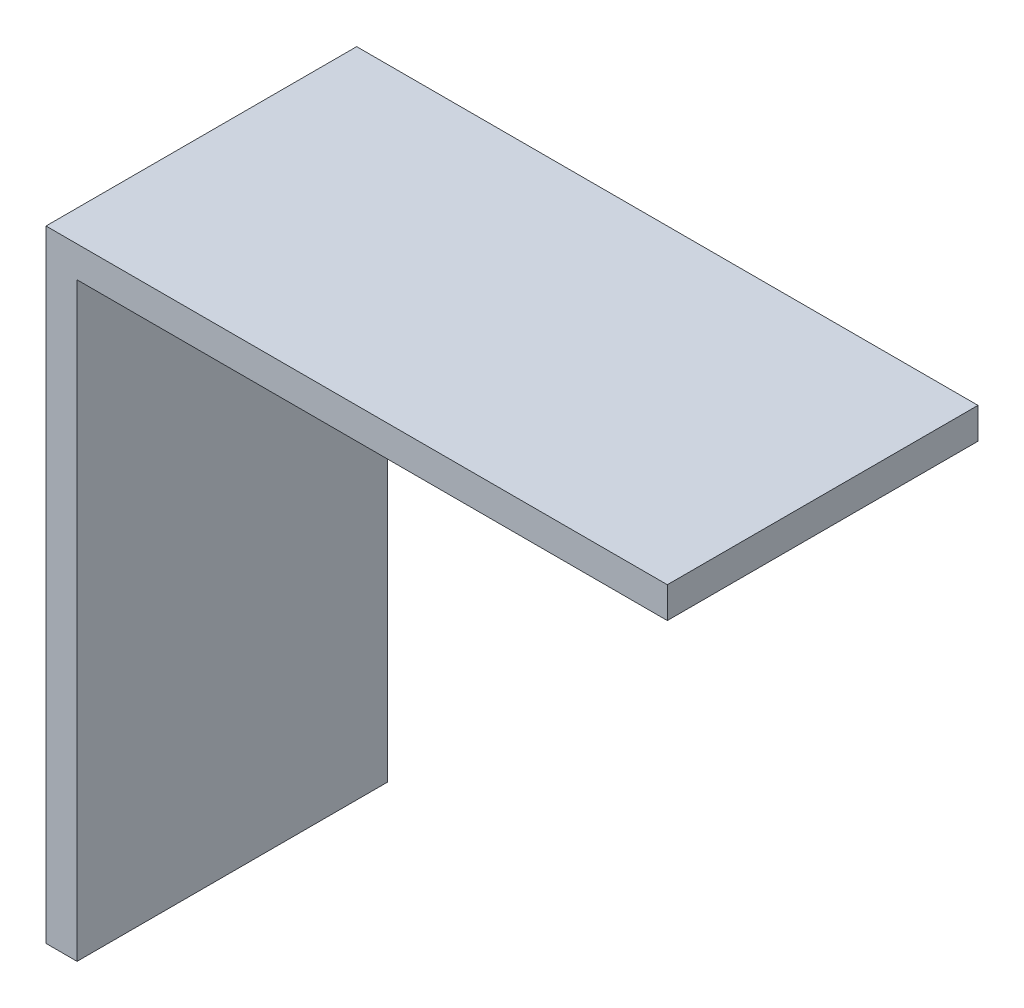
ISO-10303-21;
HEADER;
FILE_DESCRIPTION(('STEP AP214'),'2;1');
FILE_NAME('part.step','',(''),(''),'','','');
FILE_SCHEMA(('AUTOMOTIVE_DESIGN { 1 0 10303 214 1 1 1 1 }'));
ENDSEC;
DATA;
#1=APPLICATION_CONTEXT('core data for automotive mechanical design processes');
#2=APPLICATION_PROTOCOL_DEFINITION('international standard','automotive_design',2000,#1);
#3=PRODUCT_CONTEXT('',#1,'mechanical');
#4=PRODUCT('Part','Part','',(#3));
#5=PRODUCT_RELATED_PRODUCT_CATEGORY('part','',(#4));
#6=PRODUCT_DEFINITION_FORMATION('','',#4);
#7=PRODUCT_DEFINITION_CONTEXT('part definition',#1,'design');
#8=PRODUCT_DEFINITION('design','',#6,#7);
#9=PRODUCT_DEFINITION_SHAPE('','',#8);
#10=(LENGTH_UNIT() NAMED_UNIT(*) SI_UNIT(.MILLI.,.METRE.));
#11=(NAMED_UNIT(*) PLANE_ANGLE_UNIT() SI_UNIT($,.RADIAN.));
#12=(NAMED_UNIT(*) SI_UNIT($,.STERADIAN.) SOLID_ANGLE_UNIT());
#13=UNCERTAINTY_MEASURE_WITH_UNIT(LENGTH_MEASURE(1.E-05),#10,'distance_accuracy_value','');
#14=(GEOMETRIC_REPRESENTATION_CONTEXT(3) GLOBAL_UNCERTAINTY_ASSIGNED_CONTEXT((#13)) GLOBAL_UNIT_ASSIGNED_CONTEXT((#10,
#11,#12)) REPRESENTATION_CONTEXT('',''));
#15=CARTESIAN_POINT('',(0.,0.,0.));
#16=DIRECTION('',(0.,0.,1.));
#17=DIRECTION('',(1.,0.,0.));
#18=AXIS2_PLACEMENT_3D('',#15,#16,#17);
#19=CARTESIAN_POINT('',(20.,2.,-10.));
#20=DIRECTION('',(-1.,0.,0.));
#21=DIRECTION('',(0.,0.,1.));
#22=AXIS2_PLACEMENT_3D('',#19,#20,#21);
#23=PLANE('',#22);
#24=DIRECTION('',(0.,0.,-1.));
#25=VECTOR('',#24,1.);
#26=CARTESIAN_POINT('',(20.,0.,-10.));
#27=LINE('',#26,#25);
#28=CARTESIAN_POINT('',(20.,0.,10.));
#29=VERTEX_POINT('',#28);
#30=CARTESIAN_POINT('',(20.,0.,-10.));
#31=VERTEX_POINT('',#30);
#32=EDGE_CURVE('E108',#29,#31,#27,.T.);
#33=ORIENTED_EDGE('',*,*,#32,.T.);
#34=DIRECTION('',(0.,-1.,0.));
#35=VECTOR('',#34,1.);
#36=CARTESIAN_POINT('',(20.,2.,-10.));
#37=LINE('',#36,#35);
#38=CARTESIAN_POINT('',(20.,2.,-10.));
#39=VERTEX_POINT('',#38);
#40=EDGE_CURVE('E11',#39,#31,#37,.T.);
#41=ORIENTED_EDGE('',*,*,#40,.F.);
#42=DIRECTION('',(0.,0.,-1.));
#43=VECTOR('',#42,1.);
#44=CARTESIAN_POINT('',(20.,2.,-10.));
#45=LINE('',#44,#43);
#46=CARTESIAN_POINT('',(20.,2.,10.));
#47=VERTEX_POINT('',#46);
#48=EDGE_CURVE('E119',#47,#39,#45,.T.);
#49=ORIENTED_EDGE('',*,*,#48,.F.);
#50=DIRECTION('',(0.,-1.,0.));
#51=VECTOR('',#50,1.);
#52=CARTESIAN_POINT('',(20.,2.,10.));
#53=LINE('',#52,#51);
#54=EDGE_CURVE('E125',#47,#29,#53,.T.);
#55=ORIENTED_EDGE('',*,*,#54,.T.);
#56=EDGE_LOOP('',(#33,#41,#49,#55));
#57=FACE_BOUND('',#56,.T.);
#58=ADVANCED_FACE('F33',(#57),#23,.F.);
#59=CARTESIAN_POINT('',(-20.,2.,-10.));
#60=DIRECTION('',(0.,0.,1.));
#61=DIRECTION('',(1.,0.,0.));
#62=AXIS2_PLACEMENT_3D('',#59,#60,#61);
#63=PLANE('',#62);
#64=DIRECTION('',(-1.,0.,0.));
#65=VECTOR('',#64,1.);
#66=CARTESIAN_POINT('',(-20.,0.,-10.));
#67=LINE('',#66,#65);
#68=CARTESIAN_POINT('',(-18.,0.,-10.));
#69=VERTEX_POINT('',#68);
#70=EDGE_CURVE('E107',#31,#69,#67,.T.);
#71=ORIENTED_EDGE('',*,*,#70,.T.);
#72=DIRECTION('',(0.,1.,0.));
#73=VECTOR('',#72,1.);
#74=CARTESIAN_POINT('',(-18.,-38.,-10.));
#75=LINE('',#74,#73);
#76=CARTESIAN_POINT('',(-18.,-38.,-10.));
#77=VERTEX_POINT('',#76);
#78=EDGE_CURVE('E47',#77,#69,#75,.T.);
#79=ORIENTED_EDGE('',*,*,#78,.F.);
#80=DIRECTION('',(1.,0.,0.));
#81=VECTOR('',#80,1.);
#82=CARTESIAN_POINT('',(-20.,-38.,-10.));
#83=LINE('',#82,#81);
#84=CARTESIAN_POINT('',(-20.,-38.,-10.));
#85=VERTEX_POINT('',#84);
#86=EDGE_CURVE('E96',#85,#77,#83,.T.);
#87=ORIENTED_EDGE('',*,*,#86,.F.);
#88=DIRECTION('',(0.,-1.,0.));
#89=VECTOR('',#88,1.);
#90=CARTESIAN_POINT('',(-20.,2.,-10.));
#91=LINE('',#90,#89);
#92=CARTESIAN_POINT('',(-20.,2.,-10.));
#93=VERTEX_POINT('',#92);
#94=EDGE_CURVE('E40',#93,#85,#91,.T.);
#95=ORIENTED_EDGE('',*,*,#94,.F.);
#96=DIRECTION('',(-1.,0.,0.));
#97=VECTOR('',#96,1.);
#98=CARTESIAN_POINT('',(-20.,2.,-10.));
#99=LINE('',#98,#97);
#100=EDGE_CURVE('E78',#39,#93,#99,.T.);
#101=ORIENTED_EDGE('',*,*,#100,.F.);
#102=ORIENTED_EDGE('',*,*,#40,.T.);
#103=EDGE_LOOP('',(#71,#79,#87,#95,#101,#102));
#104=FACE_BOUND('',#103,.T.);
#105=ADVANCED_FACE('F106',(#104),#63,.F.);
#106=CARTESIAN_POINT('',(-20.,2.,-10.));
#107=DIRECTION('',(1.,0.,0.));
#108=DIRECTION('',(0.,0.,-1.));
#109=AXIS2_PLACEMENT_3D('',#106,#107,#108);
#110=PLANE('',#109);
#111=ORIENTED_EDGE('',*,*,#94,.T.);
#112=DIRECTION('',(0.,0.,-1.));
#113=VECTOR('',#112,1.);
#114=CARTESIAN_POINT('',(-20.,-38.,10.));
#115=LINE('',#114,#113);
#116=CARTESIAN_POINT('',(-20.,-38.,10.));
#117=VERTEX_POINT('',#116);
#118=EDGE_CURVE('E102',#117,#85,#115,.T.);
#119=ORIENTED_EDGE('',*,*,#118,.F.);
#120=DIRECTION('',(0.,-1.,0.));
#121=VECTOR('',#120,1.);
#122=CARTESIAN_POINT('',(-20.,2.,10.));
#123=LINE('',#122,#121);
#124=CARTESIAN_POINT('',(-20.,2.,10.));
#125=VERTEX_POINT('',#124);
#126=EDGE_CURVE('E131',#125,#117,#123,.T.);
#127=ORIENTED_EDGE('',*,*,#126,.F.);
#128=DIRECTION('',(0.,0.,1.));
#129=VECTOR('',#128,1.);
#130=CARTESIAN_POINT('',(-20.,2.,-10.));
#131=LINE('',#130,#129);
#132=EDGE_CURVE('E122',#93,#125,#131,.T.);
#133=ORIENTED_EDGE('',*,*,#132,.F.);
#134=EDGE_LOOP('',(#111,#119,#127,#133));
#135=FACE_BOUND('',#134,.T.);
#136=ADVANCED_FACE('F134',(#135),#110,.F.);
#137=CARTESIAN_POINT('',(-20.,2.,10.));
#138=DIRECTION('',(0.,0.,-1.));
#139=DIRECTION('',(-1.,0.,0.));
#140=AXIS2_PLACEMENT_3D('',#137,#138,#139);
#141=PLANE('',#140);
#142=ORIENTED_EDGE('',*,*,#126,.T.);
#143=DIRECTION('',(1.,0.,0.));
#144=VECTOR('',#143,1.);
#145=CARTESIAN_POINT('',(-20.,-38.,10.));
#146=LINE('',#145,#144);
#147=CARTESIAN_POINT('',(-18.,-38.,10.));
#148=VERTEX_POINT('',#147);
#149=EDGE_CURVE('E112',#117,#148,#146,.T.);
#150=ORIENTED_EDGE('',*,*,#149,.T.);
#151=DIRECTION('',(0.,1.,0.));
#152=VECTOR('',#151,1.);
#153=CARTESIAN_POINT('',(-18.,-38.,10.));
#154=LINE('',#153,#152);
#155=CARTESIAN_POINT('',(-18.,0.,10.));
#156=VERTEX_POINT('',#155);
#157=EDGE_CURVE('E109',#148,#156,#154,.T.);
#158=ORIENTED_EDGE('',*,*,#157,.T.);
#159=DIRECTION('',(1.,0.,0.));
#160=VECTOR('',#159,1.);
#161=CARTESIAN_POINT('',(-20.,0.,10.));
#162=LINE('',#161,#160);
#163=EDGE_CURVE('E71',#156,#29,#162,.T.);
#164=ORIENTED_EDGE('',*,*,#163,.T.);
#165=ORIENTED_EDGE('',*,*,#54,.F.);
#166=DIRECTION('',(1.,0.,0.));
#167=VECTOR('',#166,1.);
#168=CARTESIAN_POINT('',(-20.,2.,10.));
#169=LINE('',#168,#167);
#170=EDGE_CURVE('E56',#125,#47,#169,.T.);
#171=ORIENTED_EDGE('',*,*,#170,.F.);
#172=EDGE_LOOP('',(#142,#150,#158,#164,#165,#171));
#173=FACE_BOUND('',#172,.T.);
#174=ADVANCED_FACE('F150',(#173),#141,.F.);
#175=CARTESIAN_POINT('',(0.,2.,0.));
#176=DIRECTION('',(0.,1.,0.));
#177=DIRECTION('',(0.,0.,1.));
#178=AXIS2_PLACEMENT_3D('',#175,#176,#177);
#179=PLANE('',#178);
#180=ORIENTED_EDGE('',*,*,#48,.T.);
#181=ORIENTED_EDGE('',*,*,#100,.T.);
#182=ORIENTED_EDGE('',*,*,#132,.T.);
#183=ORIENTED_EDGE('',*,*,#170,.T.);
#184=EDGE_LOOP('',(#180,#181,#182,#183));
#185=FACE_BOUND('',#184,.T.);
#186=ADVANCED_FACE('F136',(#185),#179,.T.);
#187=CARTESIAN_POINT('',(0.,0.,0.));
#188=DIRECTION('',(0.,1.,0.));
#189=DIRECTION('',(0.,0.,1.));
#190=AXIS2_PLACEMENT_3D('',#187,#188,#189);
#191=PLANE('',#190);
#192=ORIENTED_EDGE('',*,*,#163,.F.);
#193=DIRECTION('',(0.,0.,-1.));
#194=VECTOR('',#193,1.);
#195=CARTESIAN_POINT('',(-18.,0.,10.));
#196=LINE('',#195,#194);
#197=EDGE_CURVE('E103',#156,#69,#196,.T.);
#198=ORIENTED_EDGE('',*,*,#197,.T.);
#199=ORIENTED_EDGE('',*,*,#70,.F.);
#200=ORIENTED_EDGE('',*,*,#32,.F.);
#201=EDGE_LOOP('',(#192,#198,#199,#200));
#202=FACE_BOUND('',#201,.T.);
#203=ADVANCED_FACE('F142',(#202),#191,.F.);
#204=CARTESIAN_POINT('',(-18.,-38.,10.));
#205=DIRECTION('',(1.,0.,0.));
#206=DIRECTION('',(0.,0.,-1.));
#207=AXIS2_PLACEMENT_3D('',#204,#205,#206);
#208=PLANE('',#207);
#209=ORIENTED_EDGE('',*,*,#197,.F.);
#210=ORIENTED_EDGE('',*,*,#157,.F.);
#211=DIRECTION('',(0.,0.,-1.));
#212=VECTOR('',#211,1.);
#213=CARTESIAN_POINT('',(-18.,-38.,10.));
#214=LINE('',#213,#212);
#215=EDGE_CURVE('E99',#148,#77,#214,.T.);
#216=ORIENTED_EDGE('',*,*,#215,.T.);
#217=ORIENTED_EDGE('',*,*,#78,.T.);
#218=EDGE_LOOP('',(#209,#210,#216,#217));
#219=FACE_BOUND('',#218,.T.);
#220=ADVANCED_FACE('F111',(#219),#208,.T.);
#221=CARTESIAN_POINT('',(0.,-38.,0.));
#222=DIRECTION('',(0.,1.,0.));
#223=DIRECTION('',(0.,0.,1.));
#224=AXIS2_PLACEMENT_3D('',#221,#222,#223);
#225=PLANE('',#224);
#226=ORIENTED_EDGE('',*,*,#86,.T.);
#227=ORIENTED_EDGE('',*,*,#215,.F.);
#228=ORIENTED_EDGE('',*,*,#149,.F.);
#229=ORIENTED_EDGE('',*,*,#118,.T.);
#230=EDGE_LOOP('',(#226,#227,#228,#229));
#231=FACE_BOUND('',#230,.T.);
#232=ADVANCED_FACE('F97',(#231),#225,.F.);
#233=CLOSED_SHELL('',(#58,#105,#136,#174,#186,#203,#220,#232));
#234=MANIFOLD_SOLID_BREP('B2',#233);
#235=ADVANCED_BREP_SHAPE_REPRESENTATION('',(#18,#234),#14);
#236=SHAPE_DEFINITION_REPRESENTATION(#9,#235);
ENDSEC;
END-ISO-10303-21;
